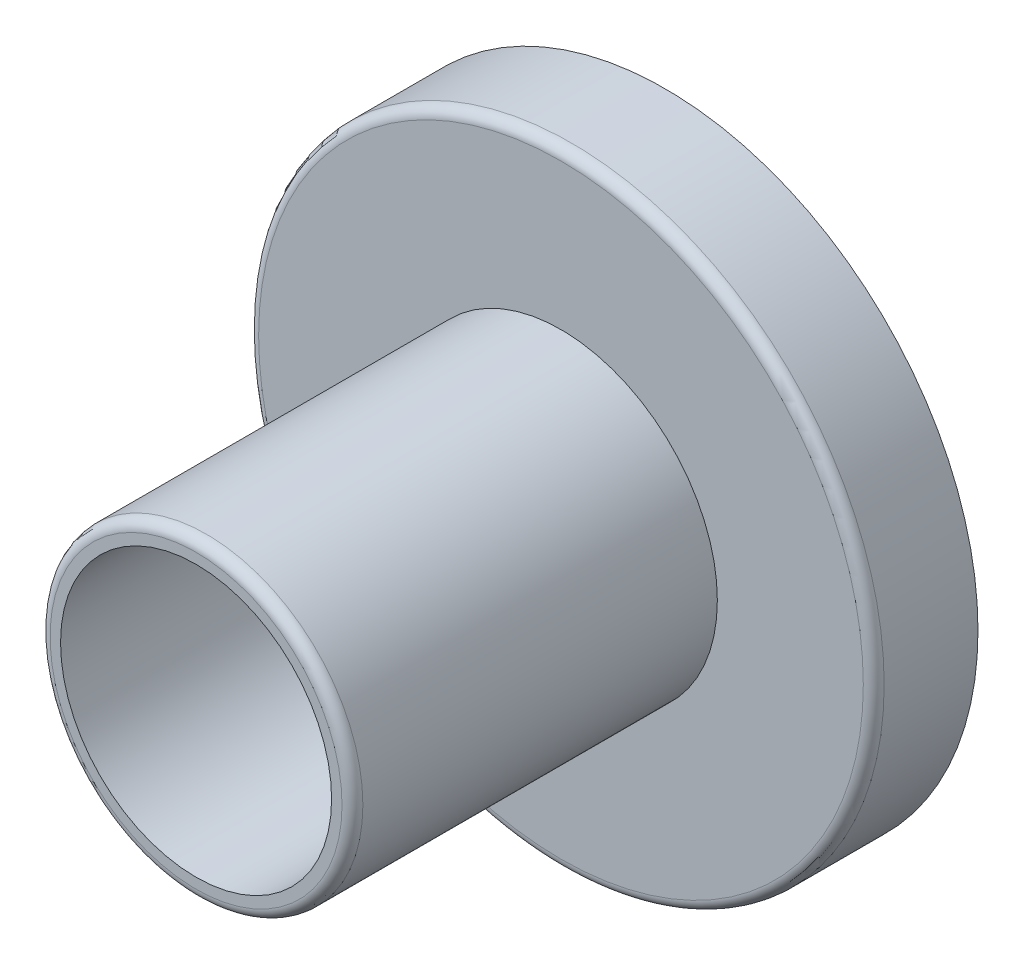
ISO-10303-21;
HEADER;
FILE_DESCRIPTION(('STEP AP214'),'2;1');
FILE_NAME('part.step','',(''),(''),'','','');
FILE_SCHEMA(('AUTOMOTIVE_DESIGN { 1 0 10303 214 1 1 1 1 }'));
ENDSEC;
DATA;
#1=APPLICATION_CONTEXT('core data for automotive mechanical design processes');
#2=APPLICATION_PROTOCOL_DEFINITION('international standard','automotive_design',2000,#1);
#3=PRODUCT_CONTEXT('',#1,'mechanical');
#4=PRODUCT('Part','Part','',(#3));
#5=PRODUCT_RELATED_PRODUCT_CATEGORY('part','',(#4));
#6=PRODUCT_DEFINITION_FORMATION('','',#4);
#7=PRODUCT_DEFINITION_CONTEXT('part definition',#1,'design');
#8=PRODUCT_DEFINITION('design','',#6,#7);
#9=PRODUCT_DEFINITION_SHAPE('','',#8);
#10=(LENGTH_UNIT() NAMED_UNIT(*) SI_UNIT(.MILLI.,.METRE.));
#11=(NAMED_UNIT(*) PLANE_ANGLE_UNIT() SI_UNIT($,.RADIAN.));
#12=(NAMED_UNIT(*) SI_UNIT($,.STERADIAN.) SOLID_ANGLE_UNIT());
#13=UNCERTAINTY_MEASURE_WITH_UNIT(LENGTH_MEASURE(1.E-05),#10,'distance_accuracy_value','');
#14=(GEOMETRIC_REPRESENTATION_CONTEXT(3) GLOBAL_UNCERTAINTY_ASSIGNED_CONTEXT((#13)) GLOBAL_UNIT_ASSIGNED_CONTEXT((#10,
#11,#12)) REPRESENTATION_CONTEXT('',''));
#15=CARTESIAN_POINT('',(0.,0.,0.));
#16=DIRECTION('',(0.,0.,1.));
#17=DIRECTION('',(1.,0.,0.));
#18=AXIS2_PLACEMENT_3D('',#15,#16,#17);
#19=CARTESIAN_POINT('',(0.,0.,10.));
#20=DIRECTION('',(0.,0.,-1.));
#21=DIRECTION('',(-1.,0.,0.));
#22=AXIS2_PLACEMENT_3D('',#19,#20,#21);
#23=CYLINDRICAL_SURFACE('',#22,30.);
#24=CARTESIAN_POINT('',(0.,0.,9.));
#25=DIRECTION('',(0.,0.,1.));
#26=DIRECTION('',(1.,0.,0.));
#27=AXIS2_PLACEMENT_3D('',#24,#25,#26);
#28=CIRCLE('',#27,30.);
#29=CARTESIAN_POINT('',(30.,0.,9.));
#30=VERTEX_POINT('',#29);
#31=EDGE_CURVE('E54',#30,#30,#28,.F.);
#32=ORIENTED_EDGE('',*,*,#31,.T.);
#33=EDGE_LOOP('',(#32));
#34=FACE_BOUND('',#33,.T.);
#35=CARTESIAN_POINT('',(0.,0.,0.));
#36=DIRECTION('',(0.,0.,1.));
#37=DIRECTION('',(1.,0.,0.));
#38=AXIS2_PLACEMENT_3D('',#35,#36,#37);
#39=CIRCLE('',#38,30.);
#40=CARTESIAN_POINT('',(30.,0.,0.));
#41=VERTEX_POINT('',#40);
#42=EDGE_CURVE('E66',#41,#41,#39,.T.);
#43=ORIENTED_EDGE('',*,*,#42,.T.);
#44=EDGE_LOOP('',(#43));
#45=FACE_BOUND('',#44,.T.);
#46=ADVANCED_FACE('F41',(#34,#45),#23,.T.);
#47=CARTESIAN_POINT('',(0.,0.,10.));
#48=DIRECTION('',(0.,0.,1.));
#49=DIRECTION('',(1.,0.,0.));
#50=AXIS2_PLACEMENT_3D('',#47,#48,#49);
#51=PLANE('',#50);
#52=CARTESIAN_POINT('',(0.,0.,10.));
#53=DIRECTION('',(0.,0.,1.));
#54=DIRECTION('',(1.,0.,0.));
#55=AXIS2_PLACEMENT_3D('',#52,#53,#54);
#56=CIRCLE('',#55,29.);
#57=CARTESIAN_POINT('',(29.,0.,10.));
#58=VERTEX_POINT('',#57);
#59=EDGE_CURVE('E59',#58,#58,#56,.T.);
#60=ORIENTED_EDGE('',*,*,#59,.T.);
#61=EDGE_LOOP('',(#60));
#62=FACE_BOUND('',#61,.T.);
#63=CARTESIAN_POINT('',(0.,0.,10.));
#64=DIRECTION('',(0.,0.,1.));
#65=DIRECTION('',(1.,0.,0.));
#66=AXIS2_PLACEMENT_3D('',#63,#64,#65);
#67=CIRCLE('',#66,15.);
#68=CARTESIAN_POINT('',(15.,0.,10.));
#69=VERTEX_POINT('',#68);
#70=EDGE_CURVE('E65',#69,#69,#67,.T.);
#71=ORIENTED_EDGE('',*,*,#70,.F.);
#72=EDGE_LOOP('',(#71));
#73=FACE_BOUND('',#72,.T.);
#74=ADVANCED_FACE('F124',(#62,#73),#51,.T.);
#75=CARTESIAN_POINT('',(0.,0.,0.));
#76=DIRECTION('',(0.,0.,1.));
#77=DIRECTION('',(1.,0.,0.));
#78=AXIS2_PLACEMENT_3D('',#75,#76,#77);
#79=PLANE('',#78);
#80=CARTESIAN_POINT('',(0.,0.,0.));
#81=DIRECTION('',(0.,0.,1.));
#82=DIRECTION('',(1.,0.,0.));
#83=AXIS2_PLACEMENT_3D('',#80,#81,#82);
#84=CIRCLE('',#83,5.);
#85=CARTESIAN_POINT('',(5.,0.,0.));
#86=VERTEX_POINT('',#85);
#87=EDGE_CURVE('E79',#86,#86,#84,.F.);
#88=ORIENTED_EDGE('',*,*,#87,.F.);
#89=EDGE_LOOP('',(#88));
#90=FACE_BOUND('',#89,.T.);
#91=ORIENTED_EDGE('',*,*,#42,.F.);
#92=EDGE_LOOP('',(#91));
#93=FACE_BOUND('',#92,.T.);
#94=ADVANCED_FACE('F130',(#90,#93),#79,.F.);
#95=CARTESIAN_POINT('',(0.,0.,45.));
#96=DIRECTION('',(0.,0.,-1.));
#97=DIRECTION('',(-1.,0.,0.));
#98=AXIS2_PLACEMENT_3D('',#95,#96,#97);
#99=CYLINDRICAL_SURFACE('',#98,15.);
#100=CARTESIAN_POINT('',(0.,0.,44.));
#101=DIRECTION('',(0.,0.,1.));
#102=DIRECTION('',(1.,0.,0.));
#103=AXIS2_PLACEMENT_3D('',#100,#101,#102);
#104=CIRCLE('',#103,15.);
#105=CARTESIAN_POINT('',(15.,0.,44.));
#106=VERTEX_POINT('',#105);
#107=EDGE_CURVE('E10',#106,#106,#104,.F.);
#108=ORIENTED_EDGE('',*,*,#107,.T.);
#109=EDGE_LOOP('',(#108));
#110=FACE_BOUND('',#109,.T.);
#111=ORIENTED_EDGE('',*,*,#70,.T.);
#112=EDGE_LOOP('',(#111));
#113=FACE_BOUND('',#112,.T.);
#114=ADVANCED_FACE('F120',(#110,#113),#99,.T.);
#115=CARTESIAN_POINT('',(0.,0.,45.));
#116=DIRECTION('',(0.,0.,1.));
#117=DIRECTION('',(1.,0.,0.));
#118=AXIS2_PLACEMENT_3D('',#115,#116,#117);
#119=PLANE('',#118);
#120=CARTESIAN_POINT('',(0.,0.,45.));
#121=DIRECTION('',(0.,0.,1.));
#122=DIRECTION('',(1.,0.,0.));
#123=AXIS2_PLACEMENT_3D('',#120,#121,#122);
#124=CIRCLE('',#123,14.);
#125=CARTESIAN_POINT('',(14.,0.,45.));
#126=VERTEX_POINT('',#125);
#127=EDGE_CURVE('E49',#126,#126,#124,.T.);
#128=ORIENTED_EDGE('',*,*,#127,.T.);
#129=EDGE_LOOP('',(#128));
#130=FACE_BOUND('',#129,.T.);
#131=CARTESIAN_POINT('',(0.,0.,45.));
#132=DIRECTION('',(0.,0.,1.));
#133=DIRECTION('',(1.,0.,0.));
#134=AXIS2_PLACEMENT_3D('',#131,#132,#133);
#135=CIRCLE('',#134,13.);
#136=CARTESIAN_POINT('',(13.,0.,45.));
#137=VERTEX_POINT('',#136);
#138=EDGE_CURVE('E74',#137,#137,#135,.T.);
#139=ORIENTED_EDGE('',*,*,#138,.F.);
#140=EDGE_LOOP('',(#139));
#141=FACE_BOUND('',#140,.T.);
#142=ADVANCED_FACE('F111',(#130,#141),#119,.T.);
#143=CARTESIAN_POINT('',(0.,0.,10.));
#144=DIRECTION('',(0.,0.,-1.));
#145=DIRECTION('',(-1.,0.,0.));
#146=AXIS2_PLACEMENT_3D('',#143,#144,#145);
#147=CYLINDRICAL_SURFACE('',#146,28.);
#148=CARTESIAN_POINT('',(0.,0.,8.));
#149=DIRECTION('',(0.,0.,1.));
#150=DIRECTION('',(1.,0.,0.));
#151=AXIS2_PLACEMENT_3D('',#148,#149,#150);
#152=CIRCLE('',#151,28.);
#153=CARTESIAN_POINT('',(28.,0.,8.));
#154=VERTEX_POINT('',#153);
#155=EDGE_CURVE('E83',#154,#154,#152,.T.);
#156=ORIENTED_EDGE('',*,*,#155,.T.);
#157=EDGE_LOOP('',(#156));
#158=FACE_BOUND('',#157,.T.);
#159=CARTESIAN_POINT('',(0.,0.,2.));
#160=DIRECTION('',(0.,0.,1.));
#161=DIRECTION('',(1.,0.,0.));
#162=AXIS2_PLACEMENT_3D('',#159,#160,#161);
#163=CIRCLE('',#162,28.);
#164=CARTESIAN_POINT('',(28.,0.,2.));
#165=VERTEX_POINT('',#164);
#166=EDGE_CURVE('E78',#165,#165,#163,.T.);
#167=ORIENTED_EDGE('',*,*,#166,.F.);
#168=EDGE_LOOP('',(#167));
#169=FACE_BOUND('',#168,.T.);
#170=ADVANCED_FACE('F109',(#158,#169),#147,.F.);
#171=CARTESIAN_POINT('',(0.,0.,8.));
#172=DIRECTION('',(0.,0.,1.));
#173=DIRECTION('',(1.,0.,0.));
#174=AXIS2_PLACEMENT_3D('',#171,#172,#173);
#175=PLANE('',#174);
#176=CARTESIAN_POINT('',(0.,0.,8.));
#177=DIRECTION('',(0.,0.,1.));
#178=DIRECTION('',(1.,0.,0.));
#179=AXIS2_PLACEMENT_3D('',#176,#177,#178);
#180=CIRCLE('',#179,13.);
#181=CARTESIAN_POINT('',(13.,0.,8.));
#182=VERTEX_POINT('',#181);
#183=EDGE_CURVE('E70',#182,#182,#180,.T.);
#184=ORIENTED_EDGE('',*,*,#183,.T.);
#185=EDGE_LOOP('',(#184));
#186=FACE_BOUND('',#185,.T.);
#187=ORIENTED_EDGE('',*,*,#155,.F.);
#188=EDGE_LOOP('',(#187));
#189=FACE_BOUND('',#188,.T.);
#190=ADVANCED_FACE('F105',(#186,#189),#175,.F.);
#191=CARTESIAN_POINT('',(0.,0.,2.));
#192=DIRECTION('',(0.,0.,1.));
#193=DIRECTION('',(1.,0.,0.));
#194=AXIS2_PLACEMENT_3D('',#191,#192,#193);
#195=PLANE('',#194);
#196=CARTESIAN_POINT('',(0.,0.,2.));
#197=DIRECTION('',(0.,0.,1.));
#198=DIRECTION('',(1.,0.,0.));
#199=AXIS2_PLACEMENT_3D('',#196,#197,#198);
#200=CIRCLE('',#199,5.);
#201=CARTESIAN_POINT('',(5.,0.,2.));
#202=VERTEX_POINT('',#201);
#203=EDGE_CURVE('E93',#202,#202,#200,.T.);
#204=ORIENTED_EDGE('',*,*,#203,.F.);
#205=EDGE_LOOP('',(#204));
#206=FACE_BOUND('',#205,.T.);
#207=ORIENTED_EDGE('',*,*,#166,.T.);
#208=EDGE_LOOP('',(#207));
#209=FACE_BOUND('',#208,.T.);
#210=ADVANCED_FACE('F101',(#206,#209),#195,.T.);
#211=CARTESIAN_POINT('',(0.,0.,45.));
#212=DIRECTION('',(0.,0.,-1.));
#213=DIRECTION('',(-1.,0.,0.));
#214=AXIS2_PLACEMENT_3D('',#211,#212,#213);
#215=CYLINDRICAL_SURFACE('',#214,13.);
#216=ORIENTED_EDGE('',*,*,#138,.T.);
#217=EDGE_LOOP('',(#216));
#218=FACE_BOUND('',#217,.T.);
#219=ORIENTED_EDGE('',*,*,#183,.F.);
#220=EDGE_LOOP('',(#219));
#221=FACE_BOUND('',#220,.T.);
#222=ADVANCED_FACE('F104',(#218,#221),#215,.F.);
#223=CARTESIAN_POINT('',(0.,0.,9.));
#224=DIRECTION('',(0.,0.,1.));
#225=DIRECTION('',(1.,0.,0.));
#226=AXIS2_PLACEMENT_3D('',#223,#224,#225);
#227=TOROIDAL_SURFACE('',#226,29.,1.);
#228=ORIENTED_EDGE('',*,*,#31,.F.);
#229=EDGE_LOOP('',(#228));
#230=FACE_BOUND('',#229,.T.);
#231=ORIENTED_EDGE('',*,*,#59,.F.);
#232=EDGE_LOOP('',(#231));
#233=FACE_BOUND('',#232,.T.);
#234=ADVANCED_FACE('F135',(#230,#233),#227,.T.);
#235=CARTESIAN_POINT('',(0.,0.,44.));
#236=DIRECTION('',(0.,0.,1.));
#237=DIRECTION('',(1.,0.,0.));
#238=AXIS2_PLACEMENT_3D('',#235,#236,#237);
#239=TOROIDAL_SURFACE('',#238,14.,1.);
#240=ORIENTED_EDGE('',*,*,#107,.F.);
#241=EDGE_LOOP('',(#240));
#242=FACE_BOUND('',#241,.T.);
#243=ORIENTED_EDGE('',*,*,#127,.F.);
#244=EDGE_LOOP('',(#243));
#245=FACE_BOUND('',#244,.T.);
#246=ADVANCED_FACE('F43',(#242,#245),#239,.T.);
#247=CARTESIAN_POINT('',(0.,0.,-0.00100000000000013));
#248=DIRECTION('',(0.,0.,1.));
#249=DIRECTION('',(1.,0.,0.));
#250=AXIS2_PLACEMENT_3D('',#247,#248,#249);
#251=CYLINDRICAL_SURFACE('',#250,5.);
#252=ORIENTED_EDGE('',*,*,#203,.T.);
#253=EDGE_LOOP('',(#252));
#254=FACE_BOUND('',#253,.T.);
#255=ORIENTED_EDGE('',*,*,#87,.T.);
#256=EDGE_LOOP('',(#255));
#257=FACE_BOUND('',#256,.T.);
#258=ADVANCED_FACE('F98',(#254,#257),#251,.F.);
#259=CLOSED_SHELL('',(#46,#74,#94,#114,#142,#170,#190,#210,#222,#234,#246,#258));
#260=MANIFOLD_SOLID_BREP('B2',#259);
#261=ADVANCED_BREP_SHAPE_REPRESENTATION('',(#18,#260),#14);
#262=SHAPE_DEFINITION_REPRESENTATION(#9,#261);
ENDSEC;
END-ISO-10303-21;
